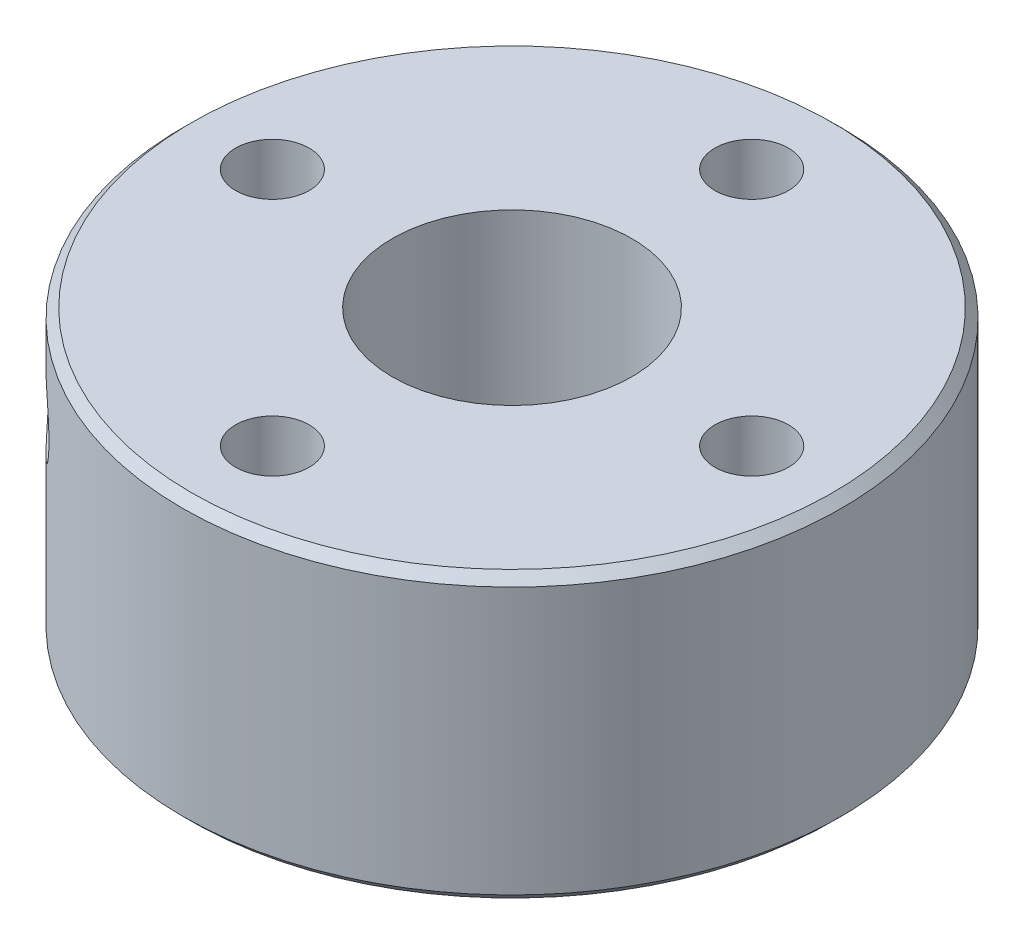
ISO-10303-21;
HEADER;
FILE_DESCRIPTION(('STEP AP214'),'2;1');
FILE_NAME('part.step','',(''),(''),'','','');
FILE_SCHEMA(('AUTOMOTIVE_DESIGN { 1 0 10303 214 1 1 1 1 }'));
ENDSEC;
DATA;
#1=APPLICATION_CONTEXT('core data for automotive mechanical design processes');
#2=APPLICATION_PROTOCOL_DEFINITION('international standard','automotive_design',2000,#1);
#3=PRODUCT_CONTEXT('',#1,'mechanical');
#4=PRODUCT('Part','Part','',(#3));
#5=PRODUCT_RELATED_PRODUCT_CATEGORY('part','',(#4));
#6=PRODUCT_DEFINITION_FORMATION('','',#4);
#7=PRODUCT_DEFINITION_CONTEXT('part definition',#1,'design');
#8=PRODUCT_DEFINITION('design','',#6,#7);
#9=PRODUCT_DEFINITION_SHAPE('','',#8);
#10=(LENGTH_UNIT() NAMED_UNIT(*) SI_UNIT(.MILLI.,.METRE.));
#11=(NAMED_UNIT(*) PLANE_ANGLE_UNIT() SI_UNIT($,.RADIAN.));
#12=(NAMED_UNIT(*) SI_UNIT($,.STERADIAN.) SOLID_ANGLE_UNIT());
#13=UNCERTAINTY_MEASURE_WITH_UNIT(LENGTH_MEASURE(1.E-05),#10,'distance_accuracy_value','');
#14=(GEOMETRIC_REPRESENTATION_CONTEXT(3) GLOBAL_UNCERTAINTY_ASSIGNED_CONTEXT((#13)) GLOBAL_UNIT_ASSIGNED_CONTEXT((#10,
#11,#12)) REPRESENTATION_CONTEXT('',''));
#15=CARTESIAN_POINT('',(0.,0.,0.));
#16=DIRECTION('',(0.,0.,1.));
#17=DIRECTION('',(1.,0.,0.));
#18=AXIS2_PLACEMENT_3D('',#15,#16,#17);
#19=CARTESIAN_POINT('',(11.,3.5,0.));
#20=DIRECTION('',(0.,-1.,0.));
#21=DIRECTION('',(0.,0.,-1.));
#22=AXIS2_PLACEMENT_3D('',#19,#20,#21);
#23=PLANE('',#22);
#24=CARTESIAN_POINT('',(0.,3.5,0.));
#25=DIRECTION('',(0.,-1.,0.));
#26=DIRECTION('',(0.,0.,-1.));
#27=AXIS2_PLACEMENT_3D('',#24,#25,#26);
#28=CIRCLE('',#27,10.7);
#29=CARTESIAN_POINT('',(0.,3.5,-10.7));
#30=VERTEX_POINT('',#29);
#31=EDGE_CURVE('E40',#30,#30,#28,.T.);
#32=ORIENTED_EDGE('',*,*,#31,.T.);
#33=EDGE_LOOP('',(#32));
#34=FACE_BOUND('',#33,.T.);
#35=CARTESIAN_POINT('',(0.,3.5,-8.));
#36=DIRECTION('',(0.,-1.,0.));
#37=DIRECTION('',(0.,0.,-1.));
#38=AXIS2_PLACEMENT_3D('',#35,#36,#37);
#39=CIRCLE('',#38,1.22949999999999);
#40=CARTESIAN_POINT('',(0.,3.5,-9.22949999999999));
#41=VERTEX_POINT('',#40);
#42=EDGE_CURVE('E111',#41,#41,#39,.T.);
#43=ORIENTED_EDGE('',*,*,#42,.F.);
#44=EDGE_LOOP('',(#43));
#45=FACE_BOUND('',#44,.T.);
#46=CARTESIAN_POINT('',(-8.,3.5,0.));
#47=DIRECTION('',(0.,-1.,0.));
#48=DIRECTION('',(0.,0.,-1.));
#49=AXIS2_PLACEMENT_3D('',#46,#47,#48);
#50=CIRCLE('',#49,1.22949999999999);
#51=CARTESIAN_POINT('',(-8.,3.5,-1.22949999999998));
#52=VERTEX_POINT('',#51);
#53=EDGE_CURVE('E115',#52,#52,#50,.T.);
#54=ORIENTED_EDGE('',*,*,#53,.F.);
#55=EDGE_LOOP('',(#54));
#56=FACE_BOUND('',#55,.T.);
#57=CARTESIAN_POINT('',(0.,3.5,8.));
#58=DIRECTION('',(0.,-1.,0.));
#59=DIRECTION('',(0.,0.,-1.));
#60=AXIS2_PLACEMENT_3D('',#57,#58,#59);
#61=CIRCLE('',#60,1.22949999999999);
#62=CARTESIAN_POINT('',(0.,3.5,6.77050000000001));
#63=VERTEX_POINT('',#62);
#64=EDGE_CURVE('E119',#63,#63,#61,.T.);
#65=ORIENTED_EDGE('',*,*,#64,.F.);
#66=EDGE_LOOP('',(#65));
#67=FACE_BOUND('',#66,.T.);
#68=CARTESIAN_POINT('',(8.,3.5,0.));
#69=DIRECTION('',(0.,-1.,0.));
#70=DIRECTION('',(0.,0.,-1.));
#71=AXIS2_PLACEMENT_3D('',#68,#69,#70);
#72=CIRCLE('',#71,1.22949999999999);
#73=CARTESIAN_POINT('',(8.,3.5,-1.22949999999998));
#74=VERTEX_POINT('',#73);
#75=EDGE_CURVE('E123',#74,#74,#72,.T.);
#76=ORIENTED_EDGE('',*,*,#75,.F.);
#77=EDGE_LOOP('',(#76));
#78=FACE_BOUND('',#77,.T.);
#79=CARTESIAN_POINT('',(0.,3.5,0.));
#80=DIRECTION('',(0.,-1.,0.));
#81=DIRECTION('',(0.,0.,-1.));
#82=AXIS2_PLACEMENT_3D('',#79,#80,#81);
#83=CIRCLE('',#82,4.75);
#84=CARTESIAN_POINT('',(0.,3.5,-4.74999999999999));
#85=VERTEX_POINT('',#84);
#86=EDGE_CURVE('E66',#85,#85,#83,.T.);
#87=ORIENTED_EDGE('',*,*,#86,.F.);
#88=EDGE_LOOP('',(#87));
#89=FACE_BOUND('',#88,.T.);
#90=ADVANCED_FACE('F33',(#34,#45,#56,#67,#78,#89),#23,.T.);
#91=CARTESIAN_POINT('',(0.,3.5,0.));
#92=DIRECTION('',(0.,1.,0.));
#93=DIRECTION('',(0.,0.,1.));
#94=AXIS2_PLACEMENT_3D('',#91,#92,#93);
#95=CYLINDRICAL_SURFACE('',#94,11.);
#96=CARTESIAN_POINT('',(0.,3.8,0.));
#97=DIRECTION('',(0.,-1.,0.));
#98=DIRECTION('',(0.,0.,-1.));
#99=AXIS2_PLACEMENT_3D('',#96,#97,#98);
#100=CIRCLE('',#99,11.);
#101=CARTESIAN_POINT('',(0.,3.8,-11.));
#102=VERTEX_POINT('',#101);
#103=EDGE_CURVE('E44',#102,#102,#100,.F.);
#104=ORIENTED_EDGE('',*,*,#103,.T.);
#105=EDGE_LOOP('',(#104));
#106=FACE_BOUND('',#105,.T.);
#107=CARTESIAN_POINT('',(0.,12.7,0.));
#108=DIRECTION('',(0.,1.,0.));
#109=DIRECTION('',(0.,0.,1.));
#110=AXIS2_PLACEMENT_3D('',#107,#108,#109);
#111=CIRCLE('',#110,11.);
#112=CARTESIAN_POINT('',(0.,12.7,11.));
#113=VERTEX_POINT('',#112);
#114=EDGE_CURVE('E48',#113,#113,#111,.F.);
#115=ORIENTED_EDGE('',*,*,#114,.T.);
#116=EDGE_LOOP('',(#115));
#117=FACE_BOUND('',#116,.T.);
#118=CARTESIAN_POINT('',(-8.59882275226415,10.,6.86004717732644));
#119=CARTESIAN_POINT('',(-8.59882129286664,9.93117027355065,6.8600499018174));
#120=CARTESIAN_POINT('',(-8.59518667033471,9.86229613969879,6.86461255723123));
#121=CARTESIAN_POINT('',(-8.58070505990485,9.72646062815853,6.88270511955675));
#122=CARTESIAN_POINT('',(-8.56985030621006,9.65950139105427,6.89624468175966));
#123=CARTESIAN_POINT('',(-8.54113611433019,9.52948225375825,6.93177555687223));
#124=CARTESIAN_POINT('',(-8.52328114749997,9.46641989416008,6.95376147453005));
#125=CARTESIAN_POINT('',(-8.48090868866089,9.34593115210057,7.00537632185254));
#126=CARTESIAN_POINT('',(-8.45639243790221,9.28850372234866,7.035003827547));
#127=CARTESIAN_POINT('',(-8.40106000598523,9.18064350076,7.10098913681331));
#128=CARTESIAN_POINT('',(-8.37021892433351,9.13023971994604,7.13737348650389));
#129=CARTESIAN_POINT('',(-8.30292643558533,9.03810775599232,7.2155434229723));
#130=CARTESIAN_POINT('',(-8.2664747621733,8.99637998489417,7.25732926612544));
#131=CARTESIAN_POINT('',(-8.18865197844227,8.92268235973943,7.34502684329077));
#132=CARTESIAN_POINT('',(-8.14726817514766,8.89073847238172,7.39094914514193));
#133=CARTESIAN_POINT('',(-8.06063605791346,8.83768158482736,7.48533534975694));
#134=CARTESIAN_POINT('',(-8.01538785998691,8.81656825961955,7.53379917620481));
#135=CARTESIAN_POINT('',(-7.92237869391432,8.78585771157843,7.63154280388263));
#136=CARTESIAN_POINT('',(-7.87462906785003,8.77621253169928,7.6808183272306));
#137=CARTESIAN_POINT('',(-7.77774587505639,8.76856357150504,7.77890866410947));
#138=CARTESIAN_POINT('',(-7.72861235250449,8.77055941999728,7.82772349228065));
#139=CARTESIAN_POINT('',(-7.63060282385128,8.78609715402838,7.92329264140649));
#140=CARTESIAN_POINT('',(-7.58172664713829,8.79958746827753,7.97005518631401));
#141=CARTESIAN_POINT('',(-7.48548004971541,8.83765072971335,8.06051817694851));
#142=CARTESIAN_POINT('',(-7.43810965268493,8.86222385109248,8.10421857453416));
#143=CARTESIAN_POINT('',(-7.3462524680981,8.92181097404819,8.18757803353648));
#144=CARTESIAN_POINT('',(-7.30177217789715,8.95684757301967,8.22722809638135));
#145=CARTESIAN_POINT('',(-7.21724446292287,9.03635067096609,8.30147892461426));
#146=CARTESIAN_POINT('',(-7.17719720081485,9.08081751579956,8.33607950473163));
#147=CARTESIAN_POINT('',(-7.10266882414202,9.17820836854335,8.39967343441055));
#148=CARTESIAN_POINT('',(-7.06821933196113,9.23117727652084,8.42863509976386));
#149=CARTESIAN_POINT('',(-7.00635601568624,9.34391362832917,8.48012975127206));
#150=CARTESIAN_POINT('',(-6.97894220644453,9.40368108651133,8.50266272385603));
#151=CARTESIAN_POINT('',(-6.93213466591203,9.52835479035665,8.54086802109923));
#152=CARTESIAN_POINT('',(-6.91274331916311,9.59326255706963,8.55653830602106));
#153=CARTESIAN_POINT('',(-6.88271886669935,9.72635573816775,8.58070835399781));
#154=CARTESIAN_POINT('',(-6.87208542582928,9.79454102702009,8.58920839145036));
#155=CARTESIAN_POINT('',(-6.86001578135319,9.93185968774098,8.59885131363562));
#156=CARTESIAN_POINT('',(-6.85853024334924,10.0009859555007,8.60003366264347));
#157=CARTESIAN_POINT('',(-6.86468155524226,10.1385699773895,8.59512431686715));
#158=CARTESIAN_POINT('',(-6.8723182504751,10.2070277428329,8.58903274540964));
#159=CARTESIAN_POINT('',(-6.8963903859812,10.3411461960801,8.56971611635838));
#160=CARTESIAN_POINT('',(-6.9128023906119,10.4068138333851,8.55651005825033));
#161=CARTESIAN_POINT('',(-6.95380062021488,10.5337046001684,8.52322415941052));
#162=CARTESIAN_POINT('',(-6.97838707725326,10.594927603407,8.50314412353161));
#163=CARTESIAN_POINT('',(-7.03496857701433,10.711476469011,8.45639193404135));
#164=CARTESIAN_POINT('',(-7.0669945967379,10.7667762209719,8.42969218495235));
#165=CARTESIAN_POINT('',(-7.13727450203434,10.8696433254806,8.37027029633066));
#166=CARTESIAN_POINT('',(-7.17552858060803,10.9172104383108,8.33754797016072));
#167=CARTESIAN_POINT('',(-7.25715381142176,11.0034803333431,8.26659846919221));
#168=CARTESIAN_POINT('',(-7.30054733997073,11.0421420210789,8.22834704969394));
#169=CARTESIAN_POINT('',(-7.39087488219221,11.1092201293992,8.14730906210454));
#170=CARTESIAN_POINT('',(-7.43780883699376,11.1376367202959,8.10452256941878));
#171=CARTESIAN_POINT('',(-7.53360671484874,11.1833491434294,8.0155492793842));
#172=CARTESIAN_POINT('',(-7.58246616180406,11.2006693192775,7.96937017484399));
#173=CARTESIAN_POINT('',(-7.68070326147241,11.2237765974083,7.87473469595186));
#174=CARTESIAN_POINT('',(-7.73008089566469,11.2295641104828,7.82627840277602));
#175=CARTESIAN_POINT('',(-7.82762916245487,11.2294351646831,7.72870979661974));
#176=CARTESIAN_POINT('',(-7.87580490581898,11.2235823074418,7.67960249688663));
#177=CARTESIAN_POINT('',(-7.96989611416686,11.2004727246223,7.58190985233426));
#178=CARTESIAN_POINT('',(-8.01581157870994,11.1832159968206,7.53332450761676));
#179=CARTESIAN_POINT('',(-8.10418756106389,11.1378072227246,7.43816933008204));
#180=CARTESIAN_POINT('',(-8.14664883688748,11.1096575747014,7.39159905611854));
#181=CARTESIAN_POINT('',(-8.22711463283213,11.0432686601022,7.30193250847853));
#182=CARTESIAN_POINT('',(-8.26511914355333,11.0050293722464,7.2588362421292));
#183=CARTESIAN_POINT('',(-8.33601872521167,10.9193093469204,7.17730664980136));
#184=CARTESIAN_POINT('',(-8.36888596969905,10.8717812190087,7.13889894974694));
#185=CARTESIAN_POINT('',(-8.42859185980105,10.7689290627491,7.0683083258122));
#186=CARTESIAN_POINT('',(-8.4554290659993,10.7136031781349,7.03612688844268));
#187=CARTESIAN_POINT('',(-8.50260660126548,10.5965325750513,6.97904440373246));
#188=CARTESIAN_POINT('',(-8.52292643825367,10.534768404314,6.9541663402228));
#189=CARTESIAN_POINT('',(-8.55654499322926,10.4067511857121,6.9127603432825));
#190=CARTESIAN_POINT('',(-8.56985150583789,10.340503213986,6.89622314068824));
#191=CARTESIAN_POINT('',(-8.58594789644361,10.2282449508027,6.87616155699825));
#192=CARTESIAN_POINT('',(-8.59077130839622,10.1829483447688,6.87012920246373));
#193=CARTESIAN_POINT('',(-8.59720921390327,10.091774405567,6.86207111546855));
#194=CARTESIAN_POINT('',(-8.59882372542038,10.0458970756512,6.8600453605799));
#195=CARTESIAN_POINT('',(-8.59882275226415,10.,6.86004717732644));
#196=B_SPLINE_CURVE_WITH_KNOTS('',3,(#118,#119,#120,#121,#122,#123,#124,#125,#126,#127,#128,
#129,#130,#131,#132,#133,#134,#135,#136,#137,#138,#139,#140,#141,#142,#143,#144,#145,#146,#147,
#148,#149,#150,#151,#152,#153,#154,#155,#156,#157,#158,#159,#160,#161,#162,#163,#164,#165,#166,
#167,#168,#169,#170,#171,#172,#173,#174,#175,#176,#177,#178,#179,#180,#181,#182,#183,#184,#185,
#186,#187,#188,#189,#190,#191,#192,#193,#194,#195),.UNSPECIFIED.,.T.,.F.,(4,2,2,2,2,2,2,2,2,2,2,
2,2,2,2,2,2,2,2,2,2,2,2,2,2,2,2,2,2,2,2,2,2,2,2,2,2,2,4),(0.,0.206321545013445,
0.412865364062192,0.619277468546969,0.825651136963587,1.03285344571688,1.24006559268876,
1.44782301394025,1.65557420029521,1.86245353056594,2.06932626419705,2.27527569668961,
2.48122836627608,2.68762907712022,2.89403735911312,3.10157391426357,3.30911090751898,
3.51670954340796,3.72430023436097,3.93077040670091,4.13723707846407,4.34315508735514,
4.54907894259134,4.75587610382279,4.96267967469486,5.17041924095308,5.3781553536347,
5.58543415443761,5.79270557186788,5.99884759351556,6.20498965535492,6.41108635713309,
6.61718349358666,6.82436093349382,7.03158777582831,7.23945994009084,7.44710058507751,
7.58468080015715,7.72226024509264),.UNSPECIFIED.);
#197=CARTESIAN_POINT('',(-8.59882275226415,10.,6.86004717732644));
#198=VERTEX_POINT('',#197);
#199=EDGE_CURVE('E78',#198,#198,#196,.T.);
#200=ORIENTED_EDGE('',*,*,#199,.F.);
#201=EDGE_LOOP('',(#200));
#202=FACE_BOUND('',#201,.T.);
#203=ADVANCED_FACE('F86',(#106,#117,#202),#95,.T.);
#204=CARTESIAN_POINT('',(0.,13.,0.));
#205=DIRECTION('',(0.,1.,0.));
#206=DIRECTION('',(0.,0.,1.));
#207=AXIS2_PLACEMENT_3D('',#204,#205,#206);
#208=PLANE('',#207);
#209=CARTESIAN_POINT('',(0.,13.,0.));
#210=DIRECTION('',(0.,1.,0.));
#211=DIRECTION('',(0.,0.,1.));
#212=AXIS2_PLACEMENT_3D('',#209,#210,#211);
#213=CIRCLE('',#212,10.7);
#214=CARTESIAN_POINT('',(0.,13.,10.7));
#215=VERTEX_POINT('',#214);
#216=EDGE_CURVE('E10',#215,#215,#213,.T.);
#217=ORIENTED_EDGE('',*,*,#216,.T.);
#218=EDGE_LOOP('',(#217));
#219=FACE_BOUND('',#218,.T.);
#220=CARTESIAN_POINT('',(0.,13.,0.));
#221=DIRECTION('',(0.,1.,0.));
#222=DIRECTION('',(0.,0.,1.));
#223=AXIS2_PLACEMENT_3D('',#220,#221,#222);
#224=CIRCLE('',#223,3.99999999999999);
#225=CARTESIAN_POINT('',(0.,13.,4.));
#226=VERTEX_POINT('',#225);
#227=EDGE_CURVE('E84',#226,#226,#224,.T.);
#228=ORIENTED_EDGE('',*,*,#227,.F.);
#229=EDGE_LOOP('',(#228));
#230=FACE_BOUND('',#229,.T.);
#231=CARTESIAN_POINT('',(0.,13.,-8.));
#232=DIRECTION('',(0.,1.,0.));
#233=DIRECTION('',(0.,0.,1.));
#234=AXIS2_PLACEMENT_3D('',#231,#232,#233);
#235=CIRCLE('',#234,1.22949999999999);
#236=CARTESIAN_POINT('',(0.,13.,-6.77050000000001));
#237=VERTEX_POINT('',#236);
#238=EDGE_CURVE('E141',#237,#237,#235,.T.);
#239=ORIENTED_EDGE('',*,*,#238,.F.);
#240=EDGE_LOOP('',(#239));
#241=FACE_BOUND('',#240,.T.);
#242=CARTESIAN_POINT('',(-8.,13.,0.));
#243=DIRECTION('',(0.,1.,0.));
#244=DIRECTION('',(0.,0.,1.));
#245=AXIS2_PLACEMENT_3D('',#242,#243,#244);
#246=CIRCLE('',#245,1.22949999999999);
#247=CARTESIAN_POINT('',(-8.,13.,1.22949999999999));
#248=VERTEX_POINT('',#247);
#249=EDGE_CURVE('E137',#248,#248,#246,.T.);
#250=ORIENTED_EDGE('',*,*,#249,.F.);
#251=EDGE_LOOP('',(#250));
#252=FACE_BOUND('',#251,.T.);
#253=CARTESIAN_POINT('',(0.,13.,8.));
#254=DIRECTION('',(0.,1.,0.));
#255=DIRECTION('',(0.,0.,1.));
#256=AXIS2_PLACEMENT_3D('',#253,#254,#255);
#257=CIRCLE('',#256,1.22949999999999);
#258=CARTESIAN_POINT('',(0.,13.,9.22949999999999));
#259=VERTEX_POINT('',#258);
#260=EDGE_CURVE('E133',#259,#259,#257,.T.);
#261=ORIENTED_EDGE('',*,*,#260,.F.);
#262=EDGE_LOOP('',(#261));
#263=FACE_BOUND('',#262,.T.);
#264=CARTESIAN_POINT('',(8.,13.,0.));
#265=DIRECTION('',(0.,1.,0.));
#266=DIRECTION('',(0.,0.,1.));
#267=AXIS2_PLACEMENT_3D('',#264,#265,#266);
#268=CIRCLE('',#267,1.22949999999999);
#269=CARTESIAN_POINT('',(8.,13.,1.22949999999999));
#270=VERTEX_POINT('',#269);
#271=EDGE_CURVE('E127',#270,#270,#268,.T.);
#272=ORIENTED_EDGE('',*,*,#271,.F.);
#273=EDGE_LOOP('',(#272));
#274=FACE_BOUND('',#273,.T.);
#275=ADVANCED_FACE('F91',(#219,#230,#241,#252,#263,#274),#208,.T.);
#276=CARTESIAN_POINT('',(0.,0.,0.));
#277=DIRECTION('',(0.,1.,0.));
#278=DIRECTION('',(0.,0.,1.));
#279=AXIS2_PLACEMENT_3D('',#276,#277,#278);
#280=CYLINDRICAL_SURFACE('',#279,4.75);
#281=CARTESIAN_POINT('',(0.,0.299999999999999,0.));
#282=DIRECTION('',(0.,-1.,0.));
#283=DIRECTION('',(0.,0.,-1.));
#284=AXIS2_PLACEMENT_3D('',#281,#282,#283);
#285=CIRCLE('',#284,4.75);
#286=CARTESIAN_POINT('',(0.,0.299999999999999,-4.74999999999999));
#287=VERTEX_POINT('',#286);
#288=EDGE_CURVE('E53',#287,#287,#285,.F.);
#289=ORIENTED_EDGE('',*,*,#288,.T.);
#290=EDGE_LOOP('',(#289));
#291=FACE_BOUND('',#290,.T.);
#292=ORIENTED_EDGE('',*,*,#86,.T.);
#293=EDGE_LOOP('',(#292));
#294=FACE_BOUND('',#293,.T.);
#295=ADVANCED_FACE('F159',(#291,#294),#280,.T.);
#296=CARTESIAN_POINT('',(0.,0.,0.));
#297=DIRECTION('',(0.,-1.,0.));
#298=DIRECTION('',(0.,0.,-1.));
#299=AXIS2_PLACEMENT_3D('',#296,#297,#298);
#300=PLANE('',#299);
#301=CARTESIAN_POINT('',(0.,0.,0.));
#302=DIRECTION('',(0.,-1.,0.));
#303=DIRECTION('',(0.,0.,-1.));
#304=AXIS2_PLACEMENT_3D('',#301,#302,#303);
#305=CIRCLE('',#304,4.45);
#306=CARTESIAN_POINT('',(0.,0.,-4.44999999999999));
#307=VERTEX_POINT('',#306);
#308=EDGE_CURVE('E56',#307,#307,#305,.T.);
#309=ORIENTED_EDGE('',*,*,#308,.T.);
#310=EDGE_LOOP('',(#309));
#311=FACE_BOUND('',#310,.T.);
#312=CARTESIAN_POINT('',(0.,0.,0.));
#313=DIRECTION('',(0.,1.,0.));
#314=DIRECTION('',(0.,0.,1.));
#315=AXIS2_PLACEMENT_3D('',#312,#313,#314);
#316=CIRCLE('',#315,2.00000000000001);
#317=CARTESIAN_POINT('',(0.,0.,2.00000000000002));
#318=VERTEX_POINT('',#317);
#319=EDGE_CURVE('E144',#318,#318,#316,.T.);
#320=ORIENTED_EDGE('',*,*,#319,.T.);
#321=EDGE_LOOP('',(#320));
#322=FACE_BOUND('',#321,.T.);
#323=ADVANCED_FACE('F171',(#311,#322),#300,.T.);
#324=CARTESIAN_POINT('',(8.,13.,0.));
#325=DIRECTION('',(0.,1.,0.));
#326=DIRECTION('',(0.,0.,1.));
#327=AXIS2_PLACEMENT_3D('',#324,#325,#326);
#328=CYLINDRICAL_SURFACE('',#327,1.22949999999999);
#329=ORIENTED_EDGE('',*,*,#75,.T.);
#330=EDGE_LOOP('',(#329));
#331=FACE_BOUND('',#330,.T.);
#332=ORIENTED_EDGE('',*,*,#271,.T.);
#333=EDGE_LOOP('',(#332));
#334=FACE_BOUND('',#333,.T.);
#335=ADVANCED_FACE('F168',(#331,#334),#328,.F.);
#336=CARTESIAN_POINT('',(0.,13.,8.));
#337=DIRECTION('',(0.,1.,0.));
#338=DIRECTION('',(0.,0.,1.));
#339=AXIS2_PLACEMENT_3D('',#336,#337,#338);
#340=CYLINDRICAL_SURFACE('',#339,1.22949999999999);
#341=ORIENTED_EDGE('',*,*,#64,.T.);
#342=EDGE_LOOP('',(#341));
#343=FACE_BOUND('',#342,.T.);
#344=ORIENTED_EDGE('',*,*,#260,.T.);
#345=EDGE_LOOP('',(#344));
#346=FACE_BOUND('',#345,.T.);
#347=ADVANCED_FACE('F170',(#343,#346),#340,.F.);
#348=CARTESIAN_POINT('',(-8.,13.,0.));
#349=DIRECTION('',(0.,1.,0.));
#350=DIRECTION('',(0.,0.,1.));
#351=AXIS2_PLACEMENT_3D('',#348,#349,#350);
#352=CYLINDRICAL_SURFACE('',#351,1.22949999999999);
#353=ORIENTED_EDGE('',*,*,#53,.T.);
#354=EDGE_LOOP('',(#353));
#355=FACE_BOUND('',#354,.T.);
#356=ORIENTED_EDGE('',*,*,#249,.T.);
#357=EDGE_LOOP('',(#356));
#358=FACE_BOUND('',#357,.T.);
#359=ADVANCED_FACE('F177',(#355,#358),#352,.F.);
#360=CARTESIAN_POINT('',(0.,13.,-8.));
#361=DIRECTION('',(0.,1.,0.));
#362=DIRECTION('',(0.,0.,1.));
#363=AXIS2_PLACEMENT_3D('',#360,#361,#362);
#364=CYLINDRICAL_SURFACE('',#363,1.22949999999999);
#365=ORIENTED_EDGE('',*,*,#42,.T.);
#366=EDGE_LOOP('',(#365));
#367=FACE_BOUND('',#366,.T.);
#368=ORIENTED_EDGE('',*,*,#238,.T.);
#369=EDGE_LOOP('',(#368));
#370=FACE_BOUND('',#369,.T.);
#371=ADVANCED_FACE('F198',(#367,#370),#364,.F.);
#372=CARTESIAN_POINT('',(0.,13.,0.));
#373=DIRECTION('',(0.,1.,0.));
#374=DIRECTION('',(0.,0.,1.));
#375=AXIS2_PLACEMENT_3D('',#372,#373,#374);
#376=CYLINDRICAL_SURFACE('',#375,2.00000000000001);
#377=ORIENTED_EDGE('',*,*,#319,.F.);
#378=EDGE_LOOP('',(#377));
#379=FACE_BOUND('',#378,.T.);
#380=CARTESIAN_POINT('',(0.,4.5,0.));
#381=DIRECTION('',(0.,1.,0.));
#382=DIRECTION('',(0.,0.,1.));
#383=AXIS2_PLACEMENT_3D('',#380,#381,#382);
#384=CIRCLE('',#383,2.00000000000001);
#385=CARTESIAN_POINT('',(0.,4.5,2.00000000000002));
#386=VERTEX_POINT('',#385);
#387=EDGE_CURVE('E147',#386,#386,#384,.T.);
#388=ORIENTED_EDGE('',*,*,#387,.T.);
#389=EDGE_LOOP('',(#388));
#390=FACE_BOUND('',#389,.T.);
#391=ADVANCED_FACE('F194',(#379,#390),#376,.F.);
#392=CARTESIAN_POINT('',(2.00000000000001,4.5,0.));
#393=DIRECTION('',(0.,-1.,0.));
#394=DIRECTION('',(0.,0.,-1.));
#395=AXIS2_PLACEMENT_3D('',#392,#393,#394);
#396=PLANE('',#395);
#397=ORIENTED_EDGE('',*,*,#387,.F.);
#398=EDGE_LOOP('',(#397));
#399=FACE_BOUND('',#398,.T.);
#400=CARTESIAN_POINT('',(0.,4.5,0.));
#401=DIRECTION('',(0.,1.,0.));
#402=DIRECTION('',(0.,0.,1.));
#403=AXIS2_PLACEMENT_3D('',#400,#401,#402);
#404=CIRCLE('',#403,3.99999999999999);
#405=CARTESIAN_POINT('',(0.,4.5,4.));
#406=VERTEX_POINT('',#405);
#407=EDGE_CURVE('E149',#406,#406,#404,.T.);
#408=ORIENTED_EDGE('',*,*,#407,.T.);
#409=EDGE_LOOP('',(#408));
#410=FACE_BOUND('',#409,.T.);
#411=ADVANCED_FACE('F197',(#399,#410),#396,.F.);
#412=CARTESIAN_POINT('',(0.,13.,0.));
#413=DIRECTION('',(0.,1.,0.));
#414=DIRECTION('',(0.,0.,1.));
#415=AXIS2_PLACEMENT_3D('',#412,#413,#414);
#416=CYLINDRICAL_SURFACE('',#415,3.99999999999999);
#417=CARTESIAN_POINT('',(-3.56088641741461,10.,1.82211084247697));
#418=CARTESIAN_POINT('',(-3.56088636044018,9.93271323239236,1.82211166057228));
#419=CARTESIAN_POINT('',(-3.55824279191973,9.86542031464729,1.82730530468804));
#420=CARTESIAN_POINT('',(-3.54765563516587,9.73280747245185,1.84777395183811));
#421=CARTESIAN_POINT('',(-3.53971047582309,9.66748813886653,1.86305194332177));
#422=CARTESIAN_POINT('',(-3.51850120608781,9.54076205874594,1.90280093089096));
#423=CARTESIAN_POINT('',(-3.50524627054824,9.47934877390323,1.92725606505075));
#424=CARTESIAN_POINT('',(-3.47335860076753,9.36185116370561,1.98414701435012));
#425=CARTESIAN_POINT('',(-3.45472497570161,9.30576772313258,2.01658415134688));
#426=CARTESIAN_POINT('',(-3.41137574632521,9.19865819722333,2.08910241543031));
#427=CARTESIAN_POINT('',(-3.38649385425278,9.147835324643,2.12938435577803));
#428=CARTESIAN_POINT('',(-3.33095125416187,9.05450275612301,2.21525961290904));
#429=CARTESIAN_POINT('',(-3.30028976733767,9.01199418211756,2.26085364518504));
#430=CARTESIAN_POINT('',(-3.23259764283245,8.93560607734146,2.35665471377096));
#431=CARTESIAN_POINT('',(-3.19544268081067,8.90193496235179,2.40694067071496));
#432=CARTESIAN_POINT('',(-3.11569403434941,8.84554820014902,2.50931332668817));
#433=CARTESIAN_POINT('',(-3.0731015871935,8.82283006621762,2.56139961409735));
#434=CARTESIAN_POINT('',(-2.98466876958245,8.78967016798867,2.66386809179658));
#435=CARTESIAN_POINT('',(-2.93896379284495,8.77888126864208,2.71425461952537));
#436=CARTESIAN_POINT('',(-2.84440930331211,8.76878714934073,2.81318562279717));
#437=CARTESIAN_POINT('',(-2.79556048513687,8.76947940128593,2.86173050150376));
#438=CARTESIAN_POINT('',(-2.69789199908769,8.78209764755673,2.95393667265013));
#439=CARTESIAN_POINT('',(-2.64912589934441,8.79364749538074,2.99770694646493));
#440=CARTESIAN_POINT('',(-2.5516088828605,8.82703702811001,3.08113815157546));
#441=CARTESIAN_POINT('',(-2.50285796730161,8.84887737645401,3.12079881771956));
#442=CARTESIAN_POINT('',(-2.40640504246629,8.90247499172924,3.19577757446895));
#443=CARTESIAN_POINT('',(-2.35872264121792,8.93434812099455,3.23103784059611));
#444=CARTESIAN_POINT('',(-2.26665411695412,9.00701413463461,3.29628089283317));
#445=CARTESIAN_POINT('',(-2.22226881009435,9.04780921773894,3.32626237474419));
#446=CARTESIAN_POINT('',(-2.13668846579986,9.13910047339346,3.38190397522514));
#447=CARTESIAN_POINT('',(-2.09569463446282,9.18992186795826,3.40734070025252));
#448=CARTESIAN_POINT('',(-2.0207064340188,9.2988253917779,3.45234167175166));
#449=CARTESIAN_POINT('',(-1.98671283455157,9.35690831827407,3.47190527261155));
#450=CARTESIAN_POINT('',(-1.92701109845606,9.47951041315459,3.50539830494747));
#451=CARTESIAN_POINT('',(-1.90139376378875,9.54409079136133,3.51926638259997));
#452=CARTESIAN_POINT('',(-1.86035872257254,9.67735267159558,3.54113149887052));
#453=CARTESIAN_POINT('',(-1.84493749231934,9.74603274783954,3.54913056588367));
#454=CARTESIAN_POINT('',(-1.82561672038283,9.88267579503358,3.55910633887849));
#455=CARTESIAN_POINT('',(-1.82129153028986,9.95056237935887,3.56130562388302));
#456=CARTESIAN_POINT('',(-1.82318645087371,10.086143202587,3.56033605796613));
#457=CARTESIAN_POINT('',(-1.82940499648719,10.1538374685427,3.55716800374775));
#458=CARTESIAN_POINT('',(-1.85169305994496,10.2851643256409,3.54561437294675));
#459=CARTESIAN_POINT('',(-1.86748510050071,10.3488574789518,3.53737566470496));
#460=CARTESIAN_POINT('',(-1.90783716400721,10.4724827344969,3.51577553199073));
#461=CARTESIAN_POINT('',(-1.93239858586756,10.53241423487,3.50241329017662));
#462=CARTESIAN_POINT('',(-1.98991926897622,10.6486664712185,3.4700628295757));
#463=CARTESIAN_POINT('',(-2.02309388570291,10.7048396427184,3.4509279260636));
#464=CARTESIAN_POINT('',(-2.0960225432001,10.8103489424882,3.4071242641586));
#465=CARTESIAN_POINT('',(-2.13577823732119,10.8596833469315,3.38245411460225));
#466=CARTESIAN_POINT('',(-2.22199843231044,10.9521442502638,3.32647919373079));
#467=CARTESIAN_POINT('',(-2.26866731976413,10.9949445224406,3.29494898054064));
#468=CARTESIAN_POINT('',(-2.36559326149792,11.0706694310964,3.22606542413734));
#469=CARTESIAN_POINT('',(-2.41585014491811,11.1035945374417,3.18871235810759));
#470=CARTESIAN_POINT('',(-2.51766488602866,11.158317372035,3.10894035881918));
#471=CARTESIAN_POINT('',(-2.5692101220145,11.1801968972725,3.06656162317438));
#472=CARTESIAN_POINT('',(-2.67206292344338,11.2124071440254,2.97736564871453));
#473=CARTESIAN_POINT('',(-2.72337055594718,11.2227413504674,2.93054975387654));
#474=CARTESIAN_POINT('',(-2.82193039803925,11.2312919563112,2.83570076161695));
#475=CARTESIAN_POINT('',(-2.86926270993315,11.2299803366133,2.78779293514954));
#476=CARTESIAN_POINT('',(-2.96070314443789,11.2164124791111,2.69048217085116));
#477=CARTESIAN_POINT('',(-3.0048114655498,11.2041569157404,2.64107932533375));
#478=CARTESIAN_POINT('',(-3.08826701267712,11.1693461925415,2.54297267364229));
#479=CARTESIAN_POINT('',(-3.12766412535923,11.1469138402577,2.49426747859603));
#480=CARTESIAN_POINT('',(-3.20164316502022,11.0924967521972,2.3985710866993));
#481=CARTESIAN_POINT('',(-3.23622427819202,11.0605104048521,2.35158018051691));
#482=CARTESIAN_POINT('',(-3.30127706387479,10.9866660981631,2.25939366080646));
#483=CARTESIAN_POINT('',(-3.33157458054523,10.9445161350955,2.21430914377304));
#484=CARTESIAN_POINT('',(-3.38651586865366,10.8520605595793,2.12933687304591));
#485=CARTESIAN_POINT('',(-3.41115796971961,10.8017525450536,2.08945065621086));
#486=CARTESIAN_POINT('',(-3.45548075500827,10.6924939317204,2.01533614548439));
#487=CARTESIAN_POINT('',(-3.47497913151384,10.6333196929467,1.98132762559641));
#488=CARTESIAN_POINT('',(-3.50801460339819,10.5091478000506,1.92223465813026));
#489=CARTESIAN_POINT('',(-3.52155430096675,10.4441527028851,1.8971463159799));
#490=CARTESIAN_POINT('',(-3.54174435321202,10.3165159659032,1.85915725330068));
#491=CARTESIAN_POINT('',(-3.54892539249878,10.2542336202343,1.84532789411869));
#492=CARTESIAN_POINT('',(-3.55849590908534,10.1279691114302,1.82680533430844));
#493=CARTESIAN_POINT('',(-3.56088647159528,10.0639873366035,1.82211006449726));
#494=CARTESIAN_POINT('',(-3.56088641741461,10.,1.82211084247697));
#495=B_SPLINE_CURVE_WITH_KNOTS('',3,(#417,#418,#419,#420,#421,#422,#423,#424,#425,#426,#427,
#428,#429,#430,#431,#432,#433,#434,#435,#436,#437,#438,#439,#440,#441,#442,#443,#444,#445,#446,
#447,#448,#449,#450,#451,#452,#453,#454,#455,#456,#457,#458,#459,#460,#461,#462,#463,#464,#465,
#466,#467,#468,#469,#470,#471,#472,#473,#474,#475,#476,#477,#478,#479,#480,#481,#482,#483,#484,
#485,#486,#487,#488,#489,#490,#491,#492,#493,#494),.UNSPECIFIED.,.T.,.F.,(4,2,2,2,2,2,2,2,2,2,2,
2,2,2,2,2,2,2,2,2,2,2,2,2,2,2,2,2,2,2,2,2,2,2,2,2,2,2,4),(0.,0.201624072764263,
0.403307922725165,0.604644772641534,0.806014987351853,1.01345060448725,1.22091419377153,
1.43290248547724,1.64484262557059,1.85043834262084,2.05598878898113,2.25467080257228,
2.45336562714238,2.65444488101846,2.85557374489114,3.06482451305133,3.27409827499637,
3.48557073241775,3.69697006814365,3.90012978234346,4.10325934309522,4.30076552374326,
4.49830322506707,4.70135713713476,4.90446213965653,5.11567083988867,5.32686948908872,
5.53648030118361,5.74602782565067,5.94712284217632,6.14820546683672,6.34692356161485,
6.54567519511713,6.75101314533283,6.95641166591897,7.16832976260415,7.38015522136549,
7.57193603470332,7.76367339808163),.UNSPECIFIED.);
#496=CARTESIAN_POINT('',(-3.56088641741461,10.,1.82211084247697));
#497=VERTEX_POINT('',#496);
#498=EDGE_CURVE('E59',#497,#497,#495,.T.);
#499=ORIENTED_EDGE('',*,*,#498,.T.);
#500=EDGE_LOOP('',(#499));
#501=FACE_BOUND('',#500,.T.);
#502=ORIENTED_EDGE('',*,*,#407,.F.);
#503=EDGE_LOOP('',(#502));
#504=FACE_BOUND('',#503,.T.);
#505=ORIENTED_EDGE('',*,*,#227,.T.);
#506=EDGE_LOOP('',(#505));
#507=FACE_BOUND('',#506,.T.);
#508=ADVANCED_FACE('F68',(#501,#504,#507),#416,.F.);
#509=CARTESIAN_POINT('',(-2.69149862994579,10.,2.69149862994579));
#510=DIRECTION('',(0.707106781186548,0.,-0.707106781186547));
#511=DIRECTION('',(-0.707106781186547,0.,-0.707106781186548));
#512=AXIS2_PLACEMENT_3D('',#509,#510,#511);
#513=CYLINDRICAL_SURFACE('',#512,1.22949999999999);
#514=ORIENTED_EDGE('',*,*,#199,.T.);
#515=EDGE_LOOP('',(#514));
#516=FACE_BOUND('',#515,.T.);
#517=ORIENTED_EDGE('',*,*,#498,.F.);
#518=EDGE_LOOP('',(#517));
#519=FACE_BOUND('',#518,.T.);
#520=ADVANCED_FACE('F71',(#516,#519),#513,.F.);
#521=CARTESIAN_POINT('',(0.,0.,0.));
#522=DIRECTION('',(0.,1.,0.));
#523=DIRECTION('',(0.,0.,1.));
#524=AXIS2_PLACEMENT_3D('',#521,#522,#523);
#525=CONICAL_SURFACE('',#524,4.45,0.78539816339745);
#526=ORIENTED_EDGE('',*,*,#288,.F.);
#527=EDGE_LOOP('',(#526));
#528=FACE_BOUND('',#527,.T.);
#529=ORIENTED_EDGE('',*,*,#308,.F.);
#530=EDGE_LOOP('',(#529));
#531=FACE_BOUND('',#530,.T.);
#532=ADVANCED_FACE('F74',(#528,#531),#525,.T.);
#533=CARTESIAN_POINT('',(0.,3.8,0.));
#534=DIRECTION('',(0.,1.,0.));
#535=DIRECTION('',(0.,0.,1.));
#536=AXIS2_PLACEMENT_3D('',#533,#534,#535);
#537=CONICAL_SURFACE('',#536,11.,0.785398163397448);
#538=ORIENTED_EDGE('',*,*,#31,.F.);
#539=EDGE_LOOP('',(#538));
#540=FACE_BOUND('',#539,.T.);
#541=ORIENTED_EDGE('',*,*,#103,.F.);
#542=EDGE_LOOP('',(#541));
#543=FACE_BOUND('',#542,.T.);
#544=ADVANCED_FACE('F95',(#540,#543),#537,.T.);
#545=CARTESIAN_POINT('',(0.,13.,0.));
#546=DIRECTION('',(0.,-1.,0.));
#547=DIRECTION('',(0.,0.,-1.));
#548=AXIS2_PLACEMENT_3D('',#545,#546,#547);
#549=CONICAL_SURFACE('',#548,10.7,0.785398163397437);
#550=ORIENTED_EDGE('',*,*,#114,.F.);
#551=EDGE_LOOP('',(#550));
#552=FACE_BOUND('',#551,.T.);
#553=ORIENTED_EDGE('',*,*,#216,.F.);
#554=EDGE_LOOP('',(#553));
#555=FACE_BOUND('',#554,.T.);
#556=ADVANCED_FACE('F35',(#552,#555),#549,.T.);
#557=CLOSED_SHELL('',(#90,#203,#275,#295,#323,#335,#347,#359,#371,#391,#411,#508,#520,#532,#544,#556));
#558=MANIFOLD_SOLID_BREP('B2',#557);
#559=ADVANCED_BREP_SHAPE_REPRESENTATION('',(#18,#558),#14);
#560=SHAPE_DEFINITION_REPRESENTATION(#9,#559);
ENDSEC;
END-ISO-10303-21;
